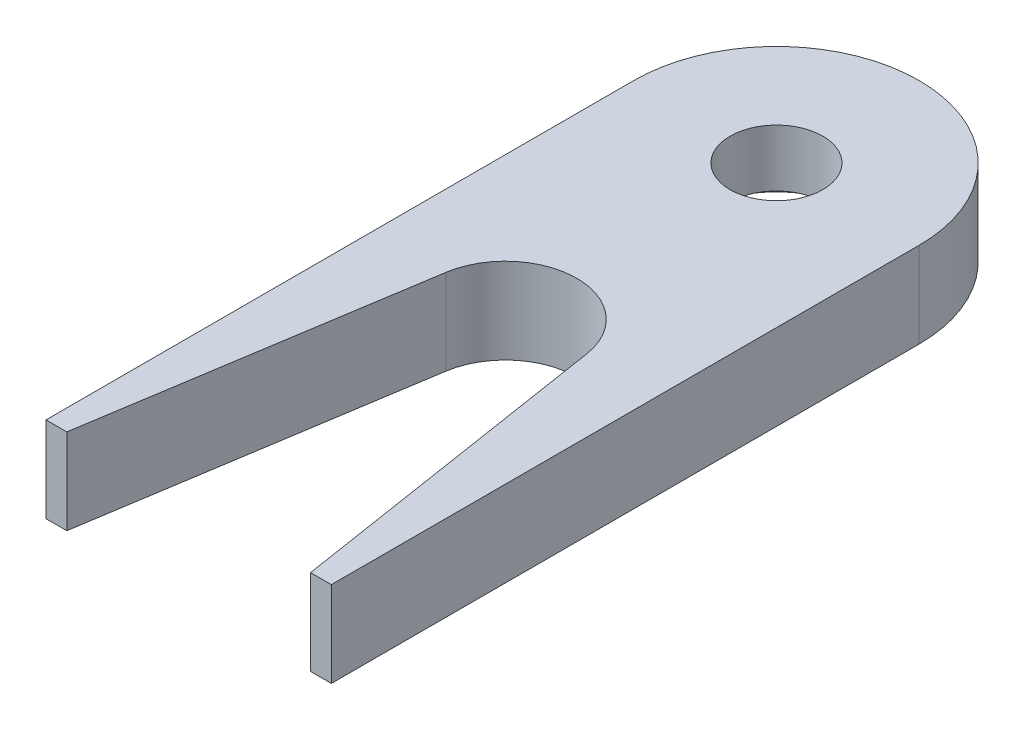
ISO-10303-21;
HEADER;
FILE_DESCRIPTION(('STEP AP214'),'2;1');
FILE_NAME('part.step','',(''),(''),'','','');
FILE_SCHEMA(('AUTOMOTIVE_DESIGN { 1 0 10303 214 1 1 1 1 }'));
ENDSEC;
DATA;
#1=APPLICATION_CONTEXT('core data for automotive mechanical design processes');
#2=APPLICATION_PROTOCOL_DEFINITION('international standard','automotive_design',2000,#1);
#3=PRODUCT_CONTEXT('',#1,'mechanical');
#4=PRODUCT('Part','Part','',(#3));
#5=PRODUCT_RELATED_PRODUCT_CATEGORY('part','',(#4));
#6=PRODUCT_DEFINITION_FORMATION('','',#4);
#7=PRODUCT_DEFINITION_CONTEXT('part definition',#1,'design');
#8=PRODUCT_DEFINITION('design','',#6,#7);
#9=PRODUCT_DEFINITION_SHAPE('','',#8);
#10=(LENGTH_UNIT() NAMED_UNIT(*) SI_UNIT(.MILLI.,.METRE.));
#11=(NAMED_UNIT(*) PLANE_ANGLE_UNIT() SI_UNIT($,.RADIAN.));
#12=(NAMED_UNIT(*) SI_UNIT($,.STERADIAN.) SOLID_ANGLE_UNIT());
#13=UNCERTAINTY_MEASURE_WITH_UNIT(LENGTH_MEASURE(1.E-05),#10,'distance_accuracy_value','');
#14=(GEOMETRIC_REPRESENTATION_CONTEXT(3) GLOBAL_UNCERTAINTY_ASSIGNED_CONTEXT((#13)) GLOBAL_UNIT_ASSIGNED_CONTEXT((#10,
#11,#12)) REPRESENTATION_CONTEXT('',''));
#15=CARTESIAN_POINT('',(0.,0.,0.));
#16=DIRECTION('',(0.,0.,1.));
#17=DIRECTION('',(1.,0.,0.));
#18=AXIS2_PLACEMENT_3D('',#15,#16,#17);
#19=CARTESIAN_POINT('',(0.,6.,0.));
#20=DIRECTION('',(0.,-1.,0.));
#21=DIRECTION('',(0.,0.,-1.));
#22=AXIS2_PLACEMENT_3D('',#19,#20,#21);
#23=CYLINDRICAL_SURFACE('',#22,3.25);
#24=CARTESIAN_POINT('',(0.,6.,0.));
#25=DIRECTION('',(0.,1.,0.));
#26=DIRECTION('',(0.,0.,1.));
#27=AXIS2_PLACEMENT_3D('',#24,#25,#26);
#28=CIRCLE('',#27,3.25);
#29=CARTESIAN_POINT('',(0.,6.,3.25));
#30=VERTEX_POINT('',#29);
#31=EDGE_CURVE('E142',#30,#30,#28,.T.);
#32=ORIENTED_EDGE('',*,*,#31,.T.);
#33=EDGE_LOOP('',(#32));
#34=FACE_BOUND('',#33,.T.);
#35=CARTESIAN_POINT('',(0.,2.,0.));
#36=DIRECTION('',(0.,-1.,0.));
#37=DIRECTION('',(0.,0.,-1.));
#38=AXIS2_PLACEMENT_3D('',#35,#36,#37);
#39=CIRCLE('',#38,3.25);
#40=CARTESIAN_POINT('',(0.,2.,-3.25));
#41=VERTEX_POINT('',#40);
#42=EDGE_CURVE('E43',#41,#41,#39,.T.);
#43=ORIENTED_EDGE('',*,*,#42,.T.);
#44=EDGE_LOOP('',(#43));
#45=FACE_BOUND('',#44,.T.);
#46=ADVANCED_FACE('F39',(#34,#45),#23,.F.);
#47=CARTESIAN_POINT('',(0.,6.,19.));
#48=DIRECTION('',(0.,-1.,0.));
#49=DIRECTION('',(0.,0.,-1.));
#50=AXIS2_PLACEMENT_3D('',#47,#48,#49);
#51=PLANE('',#50);
#52=CARTESIAN_POINT('',(0.,6.,19.));
#53=DIRECTION('',(0.,-1.,0.));
#54=DIRECTION('',(0.,0.,-1.));
#55=AXIS2_PLACEMENT_3D('',#52,#53,#54);
#56=CIRCLE('',#55,5.);
#57=CARTESIAN_POINT('',(-4.93964383830747,6.,18.2254557787505));
#58=VERTEX_POINT('',#57);
#59=CARTESIAN_POINT('',(4.93964383830747,6.,18.2254557787505));
#60=VERTEX_POINT('',#59);
#61=EDGE_CURVE('E153',#58,#60,#56,.T.);
#62=ORIENTED_EDGE('',*,*,#61,.T.);
#63=DIRECTION('',(0.154908844249907,0.,0.987928767661494));
#64=VECTOR('',#63,1.);
#65=CARTESIAN_POINT('',(4.93964383830747,6.,18.2254557787505));
#66=LINE('',#65,#64);
#67=CARTESIAN_POINT('',(8.5420114178282,6.,41.1994995186823));
#68=VERTEX_POINT('',#67);
#69=EDGE_CURVE('E100',#60,#68,#66,.T.);
#70=ORIENTED_EDGE('',*,*,#69,.T.);
#71=DIRECTION('',(1.,0.,0.));
#72=VECTOR('',#71,1.);
#73=CARTESIAN_POINT('',(10.,6.,41.1994995186823));
#74=LINE('',#73,#72);
#75=CARTESIAN_POINT('',(10.,6.,41.1994995186823));
#76=VERTEX_POINT('',#75);
#77=EDGE_CURVE('E169',#68,#76,#74,.T.);
#78=ORIENTED_EDGE('',*,*,#77,.T.);
#79=DIRECTION('',(0.,0.,-1.));
#80=VECTOR('',#79,1.);
#81=CARTESIAN_POINT('',(10.,6.,0.));
#82=LINE('',#81,#80);
#83=CARTESIAN_POINT('',(10.,6.,0.));
#84=VERTEX_POINT('',#83);
#85=EDGE_CURVE('E181',#76,#84,#82,.T.);
#86=ORIENTED_EDGE('',*,*,#85,.T.);
#87=CARTESIAN_POINT('',(0.,6.,0.));
#88=DIRECTION('',(0.,1.,0.));
#89=DIRECTION('',(0.,0.,-1.));
#90=AXIS2_PLACEMENT_3D('',#87,#88,#89);
#91=CIRCLE('',#90,10.);
#92=CARTESIAN_POINT('',(-10.,6.,0.));
#93=VERTEX_POINT('',#92);
#94=EDGE_CURVE('E120',#84,#93,#91,.T.);
#95=ORIENTED_EDGE('',*,*,#94,.T.);
#96=DIRECTION('',(0.,0.,1.));
#97=VECTOR('',#96,1.);
#98=CARTESIAN_POINT('',(-10.,6.,0.));
#99=LINE('',#98,#97);
#100=CARTESIAN_POINT('',(-10.,6.,41.1994995186823));
#101=VERTEX_POINT('',#100);
#102=EDGE_CURVE('E113',#93,#101,#99,.T.);
#103=ORIENTED_EDGE('',*,*,#102,.T.);
#104=DIRECTION('',(1.,0.,0.));
#105=VECTOR('',#104,1.);
#106=CARTESIAN_POINT('',(-10.,6.,41.1994995186823));
#107=LINE('',#106,#105);
#108=CARTESIAN_POINT('',(-8.5420114178282,6.,41.1994995186823));
#109=VERTEX_POINT('',#108);
#110=EDGE_CURVE('E118',#101,#109,#107,.T.);
#111=ORIENTED_EDGE('',*,*,#110,.T.);
#112=DIRECTION('',(0.154908844249907,0.,-0.987928767661494));
#113=VECTOR('',#112,1.);
#114=CARTESIAN_POINT('',(-4.93964383830747,6.,18.2254557787505));
#115=LINE('',#114,#113);
#116=EDGE_CURVE('E57',#109,#58,#115,.T.);
#117=ORIENTED_EDGE('',*,*,#116,.T.);
#118=EDGE_LOOP('',(#62,#70,#78,#86,#95,#103,#111,#117));
#119=FACE_BOUND('',#118,.T.);
#120=ORIENTED_EDGE('',*,*,#31,.F.);
#121=EDGE_LOOP('',(#120));
#122=FACE_BOUND('',#121,.T.);
#123=ADVANCED_FACE('F115',(#119,#122),#51,.F.);
#124=CARTESIAN_POINT('',(0.,0.,19.));
#125=DIRECTION('',(0.,-1.,0.));
#126=DIRECTION('',(0.,0.,-1.));
#127=AXIS2_PLACEMENT_3D('',#124,#125,#126);
#128=PLANE('',#127);
#129=CARTESIAN_POINT('',(0.,0.,0.));
#130=DIRECTION('',(0.,-1.,0.));
#131=DIRECTION('',(0.,0.,-1.));
#132=AXIS2_PLACEMENT_3D('',#129,#130,#131);
#133=CIRCLE('',#132,6.);
#134=CARTESIAN_POINT('',(0.,0.,-6.));
#135=VERTEX_POINT('',#134);
#136=EDGE_CURVE('E189',#135,#135,#133,.T.);
#137=ORIENTED_EDGE('',*,*,#136,.F.);
#138=EDGE_LOOP('',(#137));
#139=FACE_BOUND('',#138,.T.);
#140=CARTESIAN_POINT('',(0.,0.,19.));
#141=DIRECTION('',(0.,-1.,0.));
#142=DIRECTION('',(0.,0.,-1.));
#143=AXIS2_PLACEMENT_3D('',#140,#141,#142);
#144=CIRCLE('',#143,5.);
#145=CARTESIAN_POINT('',(-4.93964383830747,0.,18.2254557787505));
#146=VERTEX_POINT('',#145);
#147=CARTESIAN_POINT('',(4.93964383830747,0.,18.2254557787505));
#148=VERTEX_POINT('',#147);
#149=EDGE_CURVE('E138',#146,#148,#144,.T.);
#150=ORIENTED_EDGE('',*,*,#149,.F.);
#151=DIRECTION('',(0.154908844249907,0.,-0.987928767661494));
#152=VECTOR('',#151,1.);
#153=CARTESIAN_POINT('',(-4.93964383830747,0.,18.2254557787505));
#154=LINE('',#153,#152);
#155=CARTESIAN_POINT('',(-8.5420114178282,0.,41.1994995186823));
#156=VERTEX_POINT('',#155);
#157=EDGE_CURVE('E92',#156,#146,#154,.T.);
#158=ORIENTED_EDGE('',*,*,#157,.F.);
#159=DIRECTION('',(1.,0.,0.));
#160=VECTOR('',#159,1.);
#161=CARTESIAN_POINT('',(-10.,0.,41.1994995186823));
#162=LINE('',#161,#160);
#163=CARTESIAN_POINT('',(-10.,0.,41.1994995186823));
#164=VERTEX_POINT('',#163);
#165=EDGE_CURVE('E86',#164,#156,#162,.T.);
#166=ORIENTED_EDGE('',*,*,#165,.F.);
#167=DIRECTION('',(0.,0.,1.));
#168=VECTOR('',#167,1.);
#169=CARTESIAN_POINT('',(-10.,0.,0.));
#170=LINE('',#169,#168);
#171=CARTESIAN_POINT('',(-10.,0.,0.));
#172=VERTEX_POINT('',#171);
#173=EDGE_CURVE('E128',#172,#164,#170,.T.);
#174=ORIENTED_EDGE('',*,*,#173,.F.);
#175=CARTESIAN_POINT('',(0.,0.,0.));
#176=DIRECTION('',(0.,1.,0.));
#177=DIRECTION('',(0.,0.,-1.));
#178=AXIS2_PLACEMENT_3D('',#175,#176,#177);
#179=CIRCLE('',#178,10.);
#180=CARTESIAN_POINT('',(10.,0.,0.));
#181=VERTEX_POINT('',#180);
#182=EDGE_CURVE('E148',#181,#172,#179,.T.);
#183=ORIENTED_EDGE('',*,*,#182,.F.);
#184=DIRECTION('',(0.,0.,-1.));
#185=VECTOR('',#184,1.);
#186=CARTESIAN_POINT('',(10.,0.,0.));
#187=LINE('',#186,#185);
#188=CARTESIAN_POINT('',(10.,0.,41.1994995186823));
#189=VERTEX_POINT('',#188);
#190=EDGE_CURVE('E146',#189,#181,#187,.T.);
#191=ORIENTED_EDGE('',*,*,#190,.F.);
#192=DIRECTION('',(1.,0.,0.));
#193=VECTOR('',#192,1.);
#194=CARTESIAN_POINT('',(10.,0.,41.1994995186823));
#195=LINE('',#194,#193);
#196=CARTESIAN_POINT('',(8.5420114178282,0.,41.1994995186823));
#197=VERTEX_POINT('',#196);
#198=EDGE_CURVE('E144',#197,#189,#195,.T.);
#199=ORIENTED_EDGE('',*,*,#198,.F.);
#200=DIRECTION('',(0.154908844249907,0.,0.987928767661494));
#201=VECTOR('',#200,1.);
#202=CARTESIAN_POINT('',(4.93964383830747,0.,18.2254557787505));
#203=LINE('',#202,#201);
#204=EDGE_CURVE('E141',#148,#197,#203,.T.);
#205=ORIENTED_EDGE('',*,*,#204,.F.);
#206=EDGE_LOOP('',(#150,#158,#166,#174,#183,#191,#199,#205));
#207=FACE_BOUND('',#206,.T.);
#208=ADVANCED_FACE('F173',(#139,#207),#128,.T.);
#209=CARTESIAN_POINT('',(0.,6.,19.));
#210=DIRECTION('',(0.,-1.,0.));
#211=DIRECTION('',(0.,0.,-1.));
#212=AXIS2_PLACEMENT_3D('',#209,#210,#211);
#213=CYLINDRICAL_SURFACE('',#212,5.);
#214=ORIENTED_EDGE('',*,*,#149,.T.);
#215=DIRECTION('',(0.,-1.,0.));
#216=VECTOR('',#215,1.);
#217=CARTESIAN_POINT('',(4.93964383830747,6.,18.2254557787505));
#218=LINE('',#217,#216);
#219=EDGE_CURVE('E11',#60,#148,#218,.T.);
#220=ORIENTED_EDGE('',*,*,#219,.F.);
#221=ORIENTED_EDGE('',*,*,#61,.F.);
#222=DIRECTION('',(0.,-1.,0.));
#223=VECTOR('',#222,1.);
#224=CARTESIAN_POINT('',(-4.93964383830747,6.,18.2254557787505));
#225=LINE('',#224,#223);
#226=EDGE_CURVE('E134',#58,#146,#225,.T.);
#227=ORIENTED_EDGE('',*,*,#226,.T.);
#228=EDGE_LOOP('',(#214,#220,#221,#227));
#229=FACE_BOUND('',#228,.T.);
#230=ADVANCED_FACE('F41',(#229),#213,.F.);
#231=CARTESIAN_POINT('',(4.93964383830747,6.,18.2254557787505));
#232=DIRECTION('',(0.987928767661494,0.,-0.154908844249907));
#233=DIRECTION('',(-0.154908844249907,0.,-0.987928767661494));
#234=AXIS2_PLACEMENT_3D('',#231,#232,#233);
#235=PLANE('',#234);
#236=ORIENTED_EDGE('',*,*,#204,.T.);
#237=DIRECTION('',(0.,-1.,0.));
#238=VECTOR('',#237,1.);
#239=CARTESIAN_POINT('',(8.5420114178282,6.,41.1994995186823));
#240=LINE('',#239,#238);
#241=EDGE_CURVE('E49',#68,#197,#240,.T.);
#242=ORIENTED_EDGE('',*,*,#241,.F.);
#243=ORIENTED_EDGE('',*,*,#69,.F.);
#244=ORIENTED_EDGE('',*,*,#219,.T.);
#245=EDGE_LOOP('',(#236,#242,#243,#244));
#246=FACE_BOUND('',#245,.T.);
#247=ADVANCED_FACE('F232',(#246),#235,.F.);
#248=CARTESIAN_POINT('',(10.,6.,41.1994995186823));
#249=DIRECTION('',(0.,0.,-1.));
#250=DIRECTION('',(-1.,0.,0.));
#251=AXIS2_PLACEMENT_3D('',#248,#249,#250);
#252=PLANE('',#251);
#253=ORIENTED_EDGE('',*,*,#198,.T.);
#254=DIRECTION('',(0.,-1.,0.));
#255=VECTOR('',#254,1.);
#256=CARTESIAN_POINT('',(10.,6.,41.1994995186823));
#257=LINE('',#256,#255);
#258=EDGE_CURVE('E160',#76,#189,#257,.T.);
#259=ORIENTED_EDGE('',*,*,#258,.F.);
#260=ORIENTED_EDGE('',*,*,#77,.F.);
#261=ORIENTED_EDGE('',*,*,#241,.T.);
#262=EDGE_LOOP('',(#253,#259,#260,#261));
#263=FACE_BOUND('',#262,.T.);
#264=ADVANCED_FACE('F167',(#263),#252,.F.);
#265=CARTESIAN_POINT('',(10.,6.,0.));
#266=DIRECTION('',(-1.,0.,0.));
#267=DIRECTION('',(0.,0.,1.));
#268=AXIS2_PLACEMENT_3D('',#265,#266,#267);
#269=PLANE('',#268);
#270=ORIENTED_EDGE('',*,*,#190,.T.);
#271=DIRECTION('',(0.,-1.,0.));
#272=VECTOR('',#271,1.);
#273=CARTESIAN_POINT('',(10.,6.,0.));
#274=LINE('',#273,#272);
#275=EDGE_CURVE('E157',#84,#181,#274,.T.);
#276=ORIENTED_EDGE('',*,*,#275,.F.);
#277=ORIENTED_EDGE('',*,*,#85,.F.);
#278=ORIENTED_EDGE('',*,*,#258,.T.);
#279=EDGE_LOOP('',(#270,#276,#277,#278));
#280=FACE_BOUND('',#279,.T.);
#281=ADVANCED_FACE('F177',(#280),#269,.F.);
#282=CARTESIAN_POINT('',(0.,6.,0.));
#283=DIRECTION('',(0.,-1.,0.));
#284=DIRECTION('',(0.,0.,-1.));
#285=AXIS2_PLACEMENT_3D('',#282,#283,#284);
#286=CYLINDRICAL_SURFACE('',#285,10.);
#287=ORIENTED_EDGE('',*,*,#182,.T.);
#288=DIRECTION('',(0.,-1.,0.));
#289=VECTOR('',#288,1.);
#290=CARTESIAN_POINT('',(-10.,6.,0.));
#291=LINE('',#290,#289);
#292=EDGE_CURVE('E129',#93,#172,#291,.T.);
#293=ORIENTED_EDGE('',*,*,#292,.F.);
#294=ORIENTED_EDGE('',*,*,#94,.F.);
#295=ORIENTED_EDGE('',*,*,#275,.T.);
#296=EDGE_LOOP('',(#287,#293,#294,#295));
#297=FACE_BOUND('',#296,.T.);
#298=ADVANCED_FACE('F180',(#297),#286,.T.);
#299=CARTESIAN_POINT('',(-10.,6.,0.));
#300=DIRECTION('',(1.,0.,0.));
#301=DIRECTION('',(0.,0.,-1.));
#302=AXIS2_PLACEMENT_3D('',#299,#300,#301);
#303=PLANE('',#302);
#304=ORIENTED_EDGE('',*,*,#173,.T.);
#305=DIRECTION('',(0.,-1.,0.));
#306=VECTOR('',#305,1.);
#307=CARTESIAN_POINT('',(-10.,6.,41.1994995186823));
#308=LINE('',#307,#306);
#309=EDGE_CURVE('E125',#101,#164,#308,.T.);
#310=ORIENTED_EDGE('',*,*,#309,.F.);
#311=ORIENTED_EDGE('',*,*,#102,.F.);
#312=ORIENTED_EDGE('',*,*,#292,.T.);
#313=EDGE_LOOP('',(#304,#310,#311,#312));
#314=FACE_BOUND('',#313,.T.);
#315=ADVANCED_FACE('F126',(#314),#303,.F.);
#316=CARTESIAN_POINT('',(-10.,6.,41.1994995186823));
#317=DIRECTION('',(0.,0.,-1.));
#318=DIRECTION('',(-1.,0.,0.));
#319=AXIS2_PLACEMENT_3D('',#316,#317,#318);
#320=PLANE('',#319);
#321=ORIENTED_EDGE('',*,*,#165,.T.);
#322=DIRECTION('',(0.,-1.,0.));
#323=VECTOR('',#322,1.);
#324=CARTESIAN_POINT('',(-8.5420114178282,6.,41.1994995186823));
#325=LINE('',#324,#323);
#326=EDGE_CURVE('E130',#109,#156,#325,.T.);
#327=ORIENTED_EDGE('',*,*,#326,.F.);
#328=ORIENTED_EDGE('',*,*,#110,.F.);
#329=ORIENTED_EDGE('',*,*,#309,.T.);
#330=EDGE_LOOP('',(#321,#327,#328,#329));
#331=FACE_BOUND('',#330,.T.);
#332=ADVANCED_FACE('F132',(#331),#320,.F.);
#333=CARTESIAN_POINT('',(-4.93964383830747,6.,18.2254557787505));
#334=DIRECTION('',(-0.987928767661494,0.,-0.154908844249907));
#335=DIRECTION('',(-0.154908844249907,0.,0.987928767661494));
#336=AXIS2_PLACEMENT_3D('',#333,#334,#335);
#337=PLANE('',#336);
#338=ORIENTED_EDGE('',*,*,#157,.T.);
#339=ORIENTED_EDGE('',*,*,#226,.F.);
#340=ORIENTED_EDGE('',*,*,#116,.F.);
#341=ORIENTED_EDGE('',*,*,#326,.T.);
#342=EDGE_LOOP('',(#338,#339,#340,#341));
#343=FACE_BOUND('',#342,.T.);
#344=ADVANCED_FACE('F207',(#343),#337,.F.);
#345=CARTESIAN_POINT('',(0.,2.,0.));
#346=DIRECTION('',(0.,-1.,0.));
#347=DIRECTION('',(0.,0.,-1.));
#348=AXIS2_PLACEMENT_3D('',#345,#346,#347);
#349=CYLINDRICAL_SURFACE('',#348,6.);
#350=CARTESIAN_POINT('',(0.,2.,0.));
#351=DIRECTION('',(0.,-1.,0.));
#352=DIRECTION('',(0.,0.,-1.));
#353=AXIS2_PLACEMENT_3D('',#350,#351,#352);
#354=CIRCLE('',#353,6.);
#355=CARTESIAN_POINT('',(0.,2.,-6.));
#356=VERTEX_POINT('',#355);
#357=EDGE_CURVE('E192',#356,#356,#354,.T.);
#358=ORIENTED_EDGE('',*,*,#357,.F.);
#359=EDGE_LOOP('',(#358));
#360=FACE_BOUND('',#359,.T.);
#361=ORIENTED_EDGE('',*,*,#136,.T.);
#362=EDGE_LOOP('',(#361));
#363=FACE_BOUND('',#362,.T.);
#364=ADVANCED_FACE('F202',(#360,#363),#349,.F.);
#365=CARTESIAN_POINT('',(0.,2.,0.));
#366=DIRECTION('',(0.,-1.,0.));
#367=DIRECTION('',(0.,0.,-1.));
#368=AXIS2_PLACEMENT_3D('',#365,#366,#367);
#369=PLANE('',#368);
#370=ORIENTED_EDGE('',*,*,#42,.F.);
#371=EDGE_LOOP('',(#370));
#372=FACE_BOUND('',#371,.T.);
#373=ORIENTED_EDGE('',*,*,#357,.T.);
#374=EDGE_LOOP('',(#373));
#375=FACE_BOUND('',#374,.T.);
#376=ADVANCED_FACE('F200',(#372,#375),#369,.T.);
#377=CLOSED_SHELL('',(#46,#123,#208,#230,#247,#264,#281,#298,#315,#332,#344,#364,#376));
#378=MANIFOLD_SOLID_BREP('B2',#377);
#379=ADVANCED_BREP_SHAPE_REPRESENTATION('',(#18,#378),#14);
#380=SHAPE_DEFINITION_REPRESENTATION(#9,#379);
ENDSEC;
END-ISO-10303-21;
